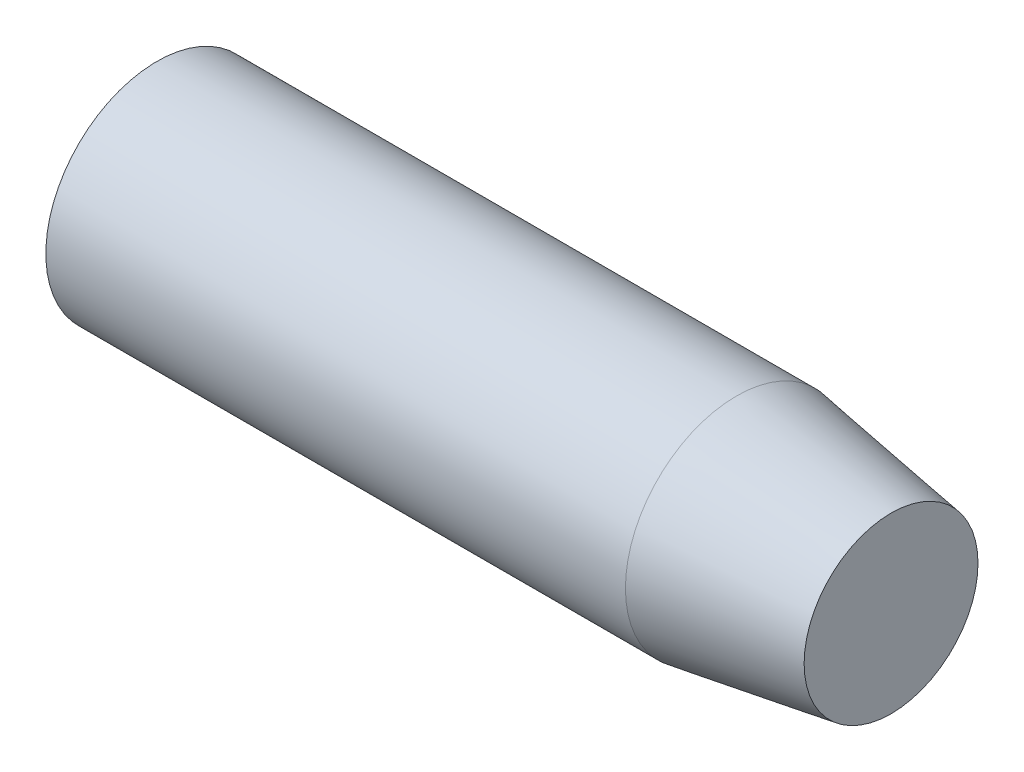
ISO-10303-21;
HEADER;
FILE_DESCRIPTION(('STEP AP214'),'2;1');
FILE_NAME('part.step','',(''),(''),'','','');
FILE_SCHEMA(('AUTOMOTIVE_DESIGN { 1 0 10303 214 1 1 1 1 }'));
ENDSEC;
DATA;
#1=APPLICATION_CONTEXT('core data for automotive mechanical design processes');
#2=APPLICATION_PROTOCOL_DEFINITION('international standard','automotive_design',2000,#1);
#3=PRODUCT_CONTEXT('',#1,'mechanical');
#4=PRODUCT('Part','Part','',(#3));
#5=PRODUCT_RELATED_PRODUCT_CATEGORY('part','',(#4));
#6=PRODUCT_DEFINITION_FORMATION('','',#4);
#7=PRODUCT_DEFINITION_CONTEXT('part definition',#1,'design');
#8=PRODUCT_DEFINITION('design','',#6,#7);
#9=PRODUCT_DEFINITION_SHAPE('','',#8);
#10=(LENGTH_UNIT() NAMED_UNIT(*) SI_UNIT(.MILLI.,.METRE.));
#11=(NAMED_UNIT(*) PLANE_ANGLE_UNIT() SI_UNIT($,.RADIAN.));
#12=(NAMED_UNIT(*) SI_UNIT($,.STERADIAN.) SOLID_ANGLE_UNIT());
#13=UNCERTAINTY_MEASURE_WITH_UNIT(LENGTH_MEASURE(1.E-05),#10,'distance_accuracy_value','');
#14=(GEOMETRIC_REPRESENTATION_CONTEXT(3) GLOBAL_UNCERTAINTY_ASSIGNED_CONTEXT((#13)) GLOBAL_UNIT_ASSIGNED_CONTEXT((#10,
#11,#12)) REPRESENTATION_CONTEXT('',''));
#15=CARTESIAN_POINT('',(0.,0.,0.));
#16=DIRECTION('',(0.,0.,1.));
#17=DIRECTION('',(1.,0.,0.));
#18=AXIS2_PLACEMENT_3D('',#15,#16,#17);
#19=CARTESIAN_POINT('',(120.65,0.,0.));
#20=DIRECTION('',(1.,0.,0.));
#21=DIRECTION('',(0.,0.,-1.));
#22=AXIS2_PLACEMENT_3D('',#19,#20,#21);
#23=PLANE('',#22);
#24=CARTESIAN_POINT('',(120.65,0.,0.));
#25=DIRECTION('',(-1.,0.,0.));
#26=DIRECTION('',(0.,0.,1.));
#27=AXIS2_PLACEMENT_3D('',#24,#25,#26);
#28=CIRCLE('',#27,14.287500000001);
#29=CARTESIAN_POINT('',(120.65,0.,14.287500000001));
#30=VERTEX_POINT('',#29);
#31=EDGE_CURVE('E17',#30,#30,#28,.T.);
#32=ORIENTED_EDGE('',*,*,#31,.F.);
#33=EDGE_LOOP('',(#32));
#34=FACE_BOUND('',#33,.T.);
#35=ADVANCED_FACE('F14',(#34),#23,.T.);
#36=CARTESIAN_POINT('',(0.,0.,0.));
#37=DIRECTION('',(1.,0.,0.));
#38=DIRECTION('',(0.,0.,-1.));
#39=AXIS2_PLACEMENT_3D('',#36,#37,#38);
#40=PLANE('',#39);
#41=CARTESIAN_POINT('',(0.,0.,0.));
#42=DIRECTION('',(1.,0.,0.));
#43=DIRECTION('',(0.,0.,-1.));
#44=AXIS2_PLACEMENT_3D('',#41,#42,#43);
#45=CIRCLE('',#44,18.25625);
#46=CARTESIAN_POINT('',(0.,0.,-18.25625));
#47=VERTEX_POINT('',#46);
#48=EDGE_CURVE('E21',#47,#47,#45,.T.);
#49=ORIENTED_EDGE('',*,*,#48,.F.);
#50=EDGE_LOOP('',(#49));
#51=FACE_BOUND('',#50,.T.);
#52=ADVANCED_FACE('F34',(#51),#40,.F.);
#53=CARTESIAN_POINT('',(95.25,0.,0.));
#54=DIRECTION('',(-1.,0.,0.));
#55=DIRECTION('',(0.,0.,1.));
#56=AXIS2_PLACEMENT_3D('',#53,#54,#55);
#57=CONICAL_SURFACE('',#56,18.2562500000002,0.154996741923907);
#58=CARTESIAN_POINT('',(95.25,0.,0.));
#59=DIRECTION('',(1.,0.,0.));
#60=DIRECTION('',(0.,0.,-1.));
#61=AXIS2_PLACEMENT_3D('',#58,#59,#60);
#62=CIRCLE('',#61,18.25625);
#63=CARTESIAN_POINT('',(95.25,0.,-18.25625));
#64=VERTEX_POINT('',#63);
#65=EDGE_CURVE('E10',#64,#64,#62,.F.);
#66=ORIENTED_EDGE('',*,*,#65,.F.);
#67=EDGE_LOOP('',(#66));
#68=FACE_BOUND('',#67,.T.);
#69=ORIENTED_EDGE('',*,*,#31,.T.);
#70=EDGE_LOOP('',(#69));
#71=FACE_BOUND('',#70,.T.);
#72=ADVANCED_FACE('F31',(#68,#71),#57,.T.);
#73=CARTESIAN_POINT('',(0.,0.,0.));
#74=DIRECTION('',(1.,0.,0.));
#75=DIRECTION('',(0.,0.,-1.));
#76=AXIS2_PLACEMENT_3D('',#73,#74,#75);
#77=CYLINDRICAL_SURFACE('',#76,18.25625);
#78=ORIENTED_EDGE('',*,*,#48,.T.);
#79=EDGE_LOOP('',(#78));
#80=FACE_BOUND('',#79,.T.);
#81=ORIENTED_EDGE('',*,*,#65,.T.);
#82=EDGE_LOOP('',(#81));
#83=FACE_BOUND('',#82,.T.);
#84=ADVANCED_FACE('F40',(#80,#83),#77,.T.);
#85=CLOSED_SHELL('',(#35,#52,#72,#84));
#86=MANIFOLD_SOLID_BREP('B1',#85);
#87=ADVANCED_BREP_SHAPE_REPRESENTATION('',(#18,#86),#14);
#88=SHAPE_DEFINITION_REPRESENTATION(#9,#87);
ENDSEC;
END-ISO-10303-21;
